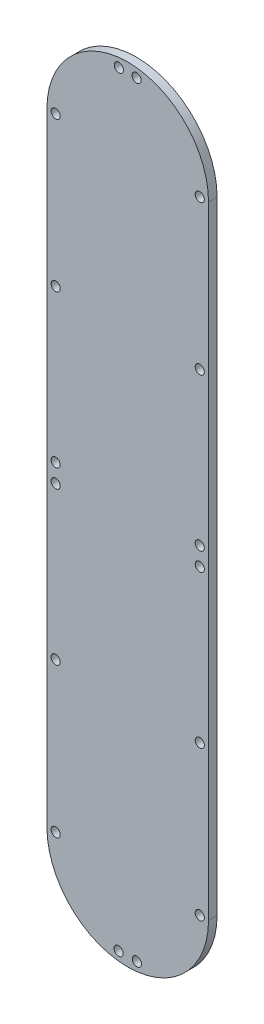
ISO-10303-21;
HEADER;
FILE_DESCRIPTION(('STEP AP214'),'2;1');
FILE_NAME('part.step','',(''),(''),'','','');
FILE_SCHEMA(('AUTOMOTIVE_DESIGN { 1 0 10303 214 1 1 1 1 }'));
ENDSEC;
DATA;
#1=APPLICATION_CONTEXT('core data for automotive mechanical design processes');
#2=APPLICATION_PROTOCOL_DEFINITION('international standard','automotive_design',2000,#1);
#3=PRODUCT_CONTEXT('',#1,'mechanical');
#4=PRODUCT('Part','Part','',(#3));
#5=PRODUCT_RELATED_PRODUCT_CATEGORY('part','',(#4));
#6=PRODUCT_DEFINITION_FORMATION('','',#4);
#7=PRODUCT_DEFINITION_CONTEXT('part definition',#1,'design');
#8=PRODUCT_DEFINITION('design','',#6,#7);
#9=PRODUCT_DEFINITION_SHAPE('','',#8);
#10=(LENGTH_UNIT() NAMED_UNIT(*) SI_UNIT(.MILLI.,.METRE.));
#11=(NAMED_UNIT(*) PLANE_ANGLE_UNIT() SI_UNIT($,.RADIAN.));
#12=(NAMED_UNIT(*) SI_UNIT($,.STERADIAN.) SOLID_ANGLE_UNIT());
#13=UNCERTAINTY_MEASURE_WITH_UNIT(LENGTH_MEASURE(1.E-05),#10,'distance_accuracy_value','');
#14=(GEOMETRIC_REPRESENTATION_CONTEXT(3) GLOBAL_UNCERTAINTY_ASSIGNED_CONTEXT((#13)) GLOBAL_UNIT_ASSIGNED_CONTEXT((#10,
#11,#12)) REPRESENTATION_CONTEXT('',''));
#15=CARTESIAN_POINT('',(0.,0.,0.));
#16=DIRECTION('',(0.,0.,1.));
#17=DIRECTION('',(1.,0.,0.));
#18=AXIS2_PLACEMENT_3D('',#15,#16,#17);
#19=CARTESIAN_POINT('',(24.5827179372451,-59.5829059297929,3.175));
#20=DIRECTION('',(0.,0.,-1.));
#21=DIRECTION('',(-1.,0.,0.));
#22=AXIS2_PLACEMENT_3D('',#19,#20,#21);
#23=CYLINDRICAL_SURFACE('',#22,30.);
#24=CARTESIAN_POINT('',(24.5827179372451,-59.5829059297929,0.));
#25=DIRECTION('',(0.,0.,-1.));
#26=DIRECTION('',(-1.,0.,0.));
#27=AXIS2_PLACEMENT_3D('',#24,#25,#26);
#28=CIRCLE('',#27,30.);
#29=CARTESIAN_POINT('',(54.5827179372451,-59.5829059297929,0.));
#30=VERTEX_POINT('',#29);
#31=CARTESIAN_POINT('',(-5.41728206275491,-59.5829059297929,0.));
#32=VERTEX_POINT('',#31);
#33=EDGE_CURVE('E98',#30,#32,#28,.T.);
#34=ORIENTED_EDGE('',*,*,#33,.F.);
#35=DIRECTION('',(0.,0.,-1.));
#36=VECTOR('',#35,1.);
#37=CARTESIAN_POINT('',(54.5827179372451,-59.5829059297929,3.175));
#38=LINE('',#37,#36);
#39=CARTESIAN_POINT('',(54.5827179372451,-59.5829059297929,3.175));
#40=VERTEX_POINT('',#39);
#41=EDGE_CURVE('E11',#40,#30,#38,.T.);
#42=ORIENTED_EDGE('',*,*,#41,.F.);
#43=CARTESIAN_POINT('',(24.5827179372451,-59.5829059297929,3.175));
#44=DIRECTION('',(0.,0.,-1.));
#45=DIRECTION('',(-1.,0.,0.));
#46=AXIS2_PLACEMENT_3D('',#43,#44,#45);
#47=CIRCLE('',#46,30.);
#48=CARTESIAN_POINT('',(-5.41728206275491,-59.5829059297929,3.175));
#49=VERTEX_POINT('',#48);
#50=EDGE_CURVE('E91',#40,#49,#47,.T.);
#51=ORIENTED_EDGE('',*,*,#50,.T.);
#52=DIRECTION('',(0.,0.,-1.));
#53=VECTOR('',#52,1.);
#54=CARTESIAN_POINT('',(-5.41728206275491,-59.5829059297929,3.175));
#55=LINE('',#54,#53);
#56=EDGE_CURVE('E36',#49,#32,#55,.T.);
#57=ORIENTED_EDGE('',*,*,#56,.T.);
#58=EDGE_LOOP('',(#34,#42,#51,#57));
#59=FACE_BOUND('',#58,.T.);
#60=ADVANCED_FACE('F33',(#59),#23,.T.);
#61=CARTESIAN_POINT('',(54.5827179372451,171.394622999198,3.175));
#62=DIRECTION('',(1.,0.,0.));
#63=DIRECTION('',(0.,1.,0.));
#64=AXIS2_PLACEMENT_3D('',#61,#62,#63);
#65=PLANE('',#64);
#66=DIRECTION('',(0.,-1.,0.));
#67=VECTOR('',#66,1.);
#68=CARTESIAN_POINT('',(54.5827179372451,171.394622999198,0.));
#69=LINE('',#68,#67);
#70=CARTESIAN_POINT('',(54.5827179372451,171.394622999198,0.));
#71=VERTEX_POINT('',#70);
#72=EDGE_CURVE('E93',#71,#30,#69,.T.);
#73=ORIENTED_EDGE('',*,*,#72,.F.);
#74=DIRECTION('',(0.,0.,-1.));
#75=VECTOR('',#74,1.);
#76=CARTESIAN_POINT('',(54.5827179372451,171.394622999198,3.175));
#77=LINE('',#76,#75);
#78=CARTESIAN_POINT('',(54.5827179372451,171.394622999198,3.175));
#79=VERTEX_POINT('',#78);
#80=EDGE_CURVE('E42',#79,#71,#77,.T.);
#81=ORIENTED_EDGE('',*,*,#80,.F.);
#82=DIRECTION('',(0.,-1.,0.));
#83=VECTOR('',#82,1.);
#84=CARTESIAN_POINT('',(54.5827179372451,171.394622999198,3.175));
#85=LINE('',#84,#83);
#86=EDGE_CURVE('E88',#79,#40,#85,.T.);
#87=ORIENTED_EDGE('',*,*,#86,.T.);
#88=ORIENTED_EDGE('',*,*,#41,.T.);
#89=EDGE_LOOP('',(#73,#81,#87,#88));
#90=FACE_BOUND('',#89,.T.);
#91=ADVANCED_FACE('F109',(#90),#65,.T.);
#92=CARTESIAN_POINT('',(24.5827179372451,171.394622999198,3.175));
#93=DIRECTION('',(0.,0.,-1.));
#94=DIRECTION('',(-1.,0.,0.));
#95=AXIS2_PLACEMENT_3D('',#92,#93,#94);
#96=CYLINDRICAL_SURFACE('',#95,30.);
#97=CARTESIAN_POINT('',(24.5827179372451,171.394622999198,0.));
#98=DIRECTION('',(0.,0.,-1.));
#99=DIRECTION('',(-1.,0.,0.));
#100=AXIS2_PLACEMENT_3D('',#97,#98,#99);
#101=CIRCLE('',#100,30.);
#102=CARTESIAN_POINT('',(-5.41728206275491,171.394622999198,0.));
#103=VERTEX_POINT('',#102);
#104=EDGE_CURVE('E83',#103,#71,#101,.T.);
#105=ORIENTED_EDGE('',*,*,#104,.F.);
#106=DIRECTION('',(0.,0.,-1.));
#107=VECTOR('',#106,1.);
#108=CARTESIAN_POINT('',(-5.41728206275491,171.394622999198,3.175));
#109=LINE('',#108,#107);
#110=CARTESIAN_POINT('',(-5.41728206275491,171.394622999198,3.175));
#111=VERTEX_POINT('',#110);
#112=EDGE_CURVE('E78',#111,#103,#109,.T.);
#113=ORIENTED_EDGE('',*,*,#112,.F.);
#114=CARTESIAN_POINT('',(24.5827179372451,171.394622999198,3.175));
#115=DIRECTION('',(0.,0.,-1.));
#116=DIRECTION('',(-1.,0.,0.));
#117=AXIS2_PLACEMENT_3D('',#114,#115,#116);
#118=CIRCLE('',#117,30.);
#119=EDGE_CURVE('E81',#111,#79,#118,.T.);
#120=ORIENTED_EDGE('',*,*,#119,.T.);
#121=ORIENTED_EDGE('',*,*,#80,.T.);
#122=EDGE_LOOP('',(#105,#113,#120,#121));
#123=FACE_BOUND('',#122,.T.);
#124=ADVANCED_FACE('F80',(#123),#96,.T.);
#125=CARTESIAN_POINT('',(-5.41728206275491,-59.5829059297929,3.175));
#126=DIRECTION('',(-1.,0.,0.));
#127=DIRECTION('',(0.,0.,1.));
#128=AXIS2_PLACEMENT_3D('',#125,#126,#127);
#129=PLANE('',#128);
#130=DIRECTION('',(0.,1.,0.));
#131=VECTOR('',#130,1.);
#132=CARTESIAN_POINT('',(-5.41728206275491,-59.5829059297929,0.));
#133=LINE('',#132,#131);
#134=EDGE_CURVE('E101',#32,#103,#133,.T.);
#135=ORIENTED_EDGE('',*,*,#134,.F.);
#136=ORIENTED_EDGE('',*,*,#56,.F.);
#137=DIRECTION('',(0.,1.,0.));
#138=VECTOR('',#137,1.);
#139=CARTESIAN_POINT('',(-5.41728206275491,-59.5829059297929,3.175));
#140=LINE('',#139,#138);
#141=EDGE_CURVE('E87',#49,#111,#140,.T.);
#142=ORIENTED_EDGE('',*,*,#141,.T.);
#143=ORIENTED_EDGE('',*,*,#112,.T.);
#144=EDGE_LOOP('',(#135,#136,#142,#143));
#145=FACE_BOUND('',#144,.T.);
#146=ADVANCED_FACE('F90',(#145),#129,.T.);
#147=CARTESIAN_POINT('',(24.5827179372451,-59.5829059297929,3.175));
#148=DIRECTION('',(0.,0.,-1.));
#149=DIRECTION('',(-1.,0.,0.));
#150=AXIS2_PLACEMENT_3D('',#147,#148,#149);
#151=PLANE('',#150);
#152=CARTESIAN_POINT('',(27.8827179372451,197.940291195723,3.175));
#153=DIRECTION('',(0.,0.,-1.));
#154=DIRECTION('',(1.,0.,0.));
#155=AXIS2_PLACEMENT_3D('',#152,#153,#154);
#156=CIRCLE('',#155,1.70000000000001);
#157=CARTESIAN_POINT('',(29.5827179372451,197.940291195723,3.175));
#158=VERTEX_POINT('',#157);
#159=EDGE_CURVE('E198',#158,#158,#156,.T.);
#160=ORIENTED_EDGE('',*,*,#159,.T.);
#161=EDGE_LOOP('',(#160));
#162=FACE_BOUND('',#161,.T.);
#163=CARTESIAN_POINT('',(-2.1672820627549,-59.5829059297927,3.175));
#164=DIRECTION('',(0.,0.,-1.));
#165=DIRECTION('',(1.,0.,0.));
#166=AXIS2_PLACEMENT_3D('',#163,#164,#165);
#167=CIRCLE('',#166,1.70000000000001);
#168=CARTESIAN_POINT('',(-0.467282062754892,-59.5829059297927,3.175));
#169=VERTEX_POINT('',#168);
#170=EDGE_CURVE('E206',#169,#169,#167,.T.);
#171=ORIENTED_EDGE('',*,*,#170,.T.);
#172=EDGE_LOOP('',(#171));
#173=FACE_BOUND('',#172,.T.);
#174=CARTESIAN_POINT('',(21.1827179372451,-86.1159513637418,3.175));
#175=DIRECTION('',(0.,0.,-1.));
#176=DIRECTION('',(1.,0.,0.));
#177=AXIS2_PLACEMENT_3D('',#174,#175,#176);
#178=CIRCLE('',#177,1.70000000000001);
#179=CARTESIAN_POINT('',(22.8827179372451,-86.1159513637418,3.175));
#180=VERTEX_POINT('',#179);
#181=EDGE_CURVE('E212',#180,#180,#178,.T.);
#182=ORIENTED_EDGE('',*,*,#181,.T.);
#183=EDGE_LOOP('',(#182));
#184=FACE_BOUND('',#183,.T.);
#185=CARTESIAN_POINT('',(51.3327179372474,171.3946229992,3.175));
#186=DIRECTION('',(0.,0.,-1.));
#187=DIRECTION('',(1.,0.,0.));
#188=AXIS2_PLACEMENT_3D('',#185,#186,#187);
#189=CIRCLE('',#188,1.70000000000001);
#190=CARTESIAN_POINT('',(53.0327179372474,171.3946229992,3.175));
#191=VERTEX_POINT('',#190);
#192=EDGE_CURVE('E218',#191,#191,#189,.T.);
#193=ORIENTED_EDGE('',*,*,#192,.T.);
#194=EDGE_LOOP('',(#193));
#195=FACE_BOUND('',#194,.T.);
#196=CARTESIAN_POINT('',(-2.1672820627549,59.3058585347025,3.175));
#197=DIRECTION('',(0.,0.,-1.));
#198=DIRECTION('',(1.,0.,0.));
#199=AXIS2_PLACEMENT_3D('',#196,#197,#198);
#200=CIRCLE('',#199,1.70000000000001);
#201=CARTESIAN_POINT('',(-0.46728206275489,59.3058585347025,3.175));
#202=VERTEX_POINT('',#201);
#203=EDGE_CURVE('E224',#202,#202,#200,.T.);
#204=ORIENTED_EDGE('',*,*,#203,.T.);
#205=EDGE_LOOP('',(#204));
#206=FACE_BOUND('',#205,.T.);
#207=CARTESIAN_POINT('',(27.9827179372451,-86.1159513637418,3.175));
#208=DIRECTION('',(0.,0.,-1.));
#209=DIRECTION('',(1.,0.,0.));
#210=AXIS2_PLACEMENT_3D('',#207,#208,#209);
#211=CIRCLE('',#210,1.70000000000001);
#212=CARTESIAN_POINT('',(29.6827179372451,-86.1159513637418,3.175));
#213=VERTEX_POINT('',#212);
#214=EDGE_CURVE('E230',#213,#213,#211,.T.);
#215=ORIENTED_EDGE('',*,*,#214,.T.);
#216=EDGE_LOOP('',(#215));
#217=FACE_BOUND('',#216,.T.);
#218=CARTESIAN_POINT('',(-2.16728206275266,171.394622999196,3.175));
#219=DIRECTION('',(0.,0.,-1.));
#220=DIRECTION('',(1.,0.,0.));
#221=AXIS2_PLACEMENT_3D('',#218,#219,#220);
#222=CIRCLE('',#221,1.70000000000001);
#223=CARTESIAN_POINT('',(-0.467282062752642,171.394622999196,3.175));
#224=VERTEX_POINT('',#223);
#225=EDGE_CURVE('E236',#224,#224,#222,.T.);
#226=ORIENTED_EDGE('',*,*,#225,.T.);
#227=EDGE_LOOP('',(#226));
#228=FACE_BOUND('',#227,.T.);
#229=CARTESIAN_POINT('',(51.3327179372449,115.905858534703,3.175));
#230=DIRECTION('',(0.,0.,-1.));
#231=DIRECTION('',(1.,0.,0.));
#232=AXIS2_PLACEMENT_3D('',#229,#230,#231);
#233=CIRCLE('',#232,1.70000000000001);
#234=CARTESIAN_POINT('',(53.0327179372449,115.905858534703,3.175));
#235=VERTEX_POINT('',#234);
#236=EDGE_CURVE('E242',#235,#235,#233,.T.);
#237=ORIENTED_EDGE('',*,*,#236,.T.);
#238=EDGE_LOOP('',(#237));
#239=FACE_BOUND('',#238,.T.);
#240=CARTESIAN_POINT('',(-2.16728206275513,115.905858534703,3.175));
#241=DIRECTION('',(0.,0.,-1.));
#242=DIRECTION('',(1.,0.,0.));
#243=AXIS2_PLACEMENT_3D('',#240,#241,#242);
#244=CIRCLE('',#243,1.70000000000001);
#245=CARTESIAN_POINT('',(-0.467282062755112,115.905858534703,3.175));
#246=VERTEX_POINT('',#245);
#247=EDGE_CURVE('E248',#246,#246,#244,.T.);
#248=ORIENTED_EDGE('',*,*,#247,.T.);
#249=EDGE_LOOP('',(#248));
#250=FACE_BOUND('',#249,.T.);
#251=CARTESIAN_POINT('',(51.3327179372451,-59.5829059297932,3.175));
#252=DIRECTION('',(0.,0.,-1.));
#253=DIRECTION('',(1.,0.,0.));
#254=AXIS2_PLACEMENT_3D('',#251,#252,#253);
#255=CIRCLE('',#254,1.7);
#256=CARTESIAN_POINT('',(53.0327179372451,-59.5829059297932,3.175));
#257=VERTEX_POINT('',#256);
#258=EDGE_CURVE('E254',#257,#257,#255,.T.);
#259=ORIENTED_EDGE('',*,*,#258,.T.);
#260=EDGE_LOOP('',(#259));
#261=FACE_BOUND('',#260,.T.);
#262=CARTESIAN_POINT('',(51.3327179372457,-4.09414146529746,3.175));
#263=DIRECTION('',(0.,0.,-1.));
#264=DIRECTION('',(1.,0.,0.));
#265=AXIS2_PLACEMENT_3D('',#262,#263,#264);
#266=CIRCLE('',#265,1.7);
#267=CARTESIAN_POINT('',(53.0327179372457,-4.09414146529746,3.175));
#268=VERTEX_POINT('',#267);
#269=EDGE_CURVE('E260',#268,#268,#266,.T.);
#270=ORIENTED_EDGE('',*,*,#269,.T.);
#271=EDGE_LOOP('',(#270));
#272=FACE_BOUND('',#271,.T.);
#273=CARTESIAN_POINT('',(-2.16728206275427,-4.09414146529746,3.175));
#274=DIRECTION('',(0.,0.,-1.));
#275=DIRECTION('',(1.,0.,0.));
#276=AXIS2_PLACEMENT_3D('',#273,#274,#275);
#277=CIRCLE('',#276,1.70000000000001);
#278=CARTESIAN_POINT('',(-0.467282062754254,-4.09414146529746,3.175));
#279=VERTEX_POINT('',#278);
#280=EDGE_CURVE('E266',#279,#279,#277,.T.);
#281=ORIENTED_EDGE('',*,*,#280,.T.);
#282=EDGE_LOOP('',(#281));
#283=FACE_BOUND('',#282,.T.);
#284=CARTESIAN_POINT('',(21.2827179372451,197.940291195723,3.175));
#285=DIRECTION('',(0.,0.,-1.));
#286=DIRECTION('',(1.,0.,0.));
#287=AXIS2_PLACEMENT_3D('',#284,#285,#286);
#288=CIRCLE('',#287,1.70000000000001);
#289=CARTESIAN_POINT('',(22.9827179372451,197.940291195723,3.175));
#290=VERTEX_POINT('',#289);
#291=EDGE_CURVE('E272',#290,#290,#288,.T.);
#292=ORIENTED_EDGE('',*,*,#291,.T.);
#293=EDGE_LOOP('',(#292));
#294=FACE_BOUND('',#293,.T.);
#295=CARTESIAN_POINT('',(51.3327179372451,52.5058585347025,3.175));
#296=DIRECTION('',(0.,0.,-1.));
#297=DIRECTION('',(1.,0.,0.));
#298=AXIS2_PLACEMENT_3D('',#295,#296,#297);
#299=CIRCLE('',#298,1.7);
#300=CARTESIAN_POINT('',(53.0327179372451,52.5058585347025,3.175));
#301=VERTEX_POINT('',#300);
#302=EDGE_CURVE('E278',#301,#301,#299,.T.);
#303=ORIENTED_EDGE('',*,*,#302,.T.);
#304=EDGE_LOOP('',(#303));
#305=FACE_BOUND('',#304,.T.);
#306=CARTESIAN_POINT('',(51.3327179372451,59.3058585347025,3.175));
#307=DIRECTION('',(0.,0.,-1.));
#308=DIRECTION('',(1.,0.,0.));
#309=AXIS2_PLACEMENT_3D('',#306,#307,#308);
#310=CIRCLE('',#309,1.7);
#311=CARTESIAN_POINT('',(53.0327179372451,59.3058585347025,3.175));
#312=VERTEX_POINT('',#311);
#313=EDGE_CURVE('E284',#312,#312,#310,.T.);
#314=ORIENTED_EDGE('',*,*,#313,.T.);
#315=EDGE_LOOP('',(#314));
#316=FACE_BOUND('',#315,.T.);
#317=CARTESIAN_POINT('',(-2.1672820627549,52.5058585347025,3.175));
#318=DIRECTION('',(0.,0.,-1.));
#319=DIRECTION('',(1.,0.,0.));
#320=AXIS2_PLACEMENT_3D('',#317,#318,#319);
#321=CIRCLE('',#320,1.70000000000001);
#322=CARTESIAN_POINT('',(-0.46728206275489,52.5058585347025,3.175));
#323=VERTEX_POINT('',#322);
#324=EDGE_CURVE('E102',#323,#323,#321,.T.);
#325=ORIENTED_EDGE('',*,*,#324,.T.);
#326=EDGE_LOOP('',(#325));
#327=FACE_BOUND('',#326,.T.);
#328=ORIENTED_EDGE('',*,*,#50,.F.);
#329=ORIENTED_EDGE('',*,*,#86,.F.);
#330=ORIENTED_EDGE('',*,*,#119,.F.);
#331=ORIENTED_EDGE('',*,*,#141,.F.);
#332=EDGE_LOOP('',(#328,#329,#330,#331));
#333=FACE_BOUND('',#332,.T.);
#334=ADVANCED_FACE('F86',(#162,#173,#184,#195,#206,#217,#228,#239,#250,#261,#272,#283,#294,#305,
#316,#327,#333),#151,.F.);
#335=CARTESIAN_POINT('',(24.5827179372451,-59.5829059297929,0.));
#336=DIRECTION('',(0.,0.,-1.));
#337=DIRECTION('',(-1.,0.,0.));
#338=AXIS2_PLACEMENT_3D('',#335,#336,#337);
#339=PLANE('',#338);
#340=CARTESIAN_POINT('',(27.8827179372451,197.940291195723,0.));
#341=DIRECTION('',(0.,0.,-1.));
#342=DIRECTION('',(1.,0.,0.));
#343=AXIS2_PLACEMENT_3D('',#340,#341,#342);
#344=CIRCLE('',#343,1.70000000000001);
#345=CARTESIAN_POINT('',(29.5827179372451,197.940291195723,0.));
#346=VERTEX_POINT('',#345);
#347=EDGE_CURVE('E201',#346,#346,#344,.T.);
#348=ORIENTED_EDGE('',*,*,#347,.F.);
#349=EDGE_LOOP('',(#348));
#350=FACE_BOUND('',#349,.T.);
#351=CARTESIAN_POINT('',(-2.1672820627549,-59.5829059297927,0.));
#352=DIRECTION('',(0.,0.,-1.));
#353=DIRECTION('',(1.,0.,0.));
#354=AXIS2_PLACEMENT_3D('',#351,#352,#353);
#355=CIRCLE('',#354,1.70000000000001);
#356=CARTESIAN_POINT('',(-0.467282062754892,-59.5829059297927,0.));
#357=VERTEX_POINT('',#356);
#358=EDGE_CURVE('E203',#357,#357,#355,.T.);
#359=ORIENTED_EDGE('',*,*,#358,.F.);
#360=EDGE_LOOP('',(#359));
#361=FACE_BOUND('',#360,.T.);
#362=CARTESIAN_POINT('',(21.1827179372451,-86.1159513637418,0.));
#363=DIRECTION('',(0.,0.,-1.));
#364=DIRECTION('',(1.,0.,0.));
#365=AXIS2_PLACEMENT_3D('',#362,#363,#364);
#366=CIRCLE('',#365,1.70000000000001);
#367=CARTESIAN_POINT('',(22.8827179372451,-86.1159513637418,0.));
#368=VERTEX_POINT('',#367);
#369=EDGE_CURVE('E209',#368,#368,#366,.T.);
#370=ORIENTED_EDGE('',*,*,#369,.F.);
#371=EDGE_LOOP('',(#370));
#372=FACE_BOUND('',#371,.T.);
#373=CARTESIAN_POINT('',(51.3327179372474,171.3946229992,0.));
#374=DIRECTION('',(0.,0.,-1.));
#375=DIRECTION('',(1.,0.,0.));
#376=AXIS2_PLACEMENT_3D('',#373,#374,#375);
#377=CIRCLE('',#376,1.70000000000001);
#378=CARTESIAN_POINT('',(53.0327179372474,171.3946229992,0.));
#379=VERTEX_POINT('',#378);
#380=EDGE_CURVE('E215',#379,#379,#377,.T.);
#381=ORIENTED_EDGE('',*,*,#380,.F.);
#382=EDGE_LOOP('',(#381));
#383=FACE_BOUND('',#382,.T.);
#384=CARTESIAN_POINT('',(-2.1672820627549,59.3058585347025,0.));
#385=DIRECTION('',(0.,0.,-1.));
#386=DIRECTION('',(1.,0.,0.));
#387=AXIS2_PLACEMENT_3D('',#384,#385,#386);
#388=CIRCLE('',#387,1.70000000000001);
#389=CARTESIAN_POINT('',(-0.46728206275489,59.3058585347025,0.));
#390=VERTEX_POINT('',#389);
#391=EDGE_CURVE('E221',#390,#390,#388,.T.);
#392=ORIENTED_EDGE('',*,*,#391,.F.);
#393=EDGE_LOOP('',(#392));
#394=FACE_BOUND('',#393,.T.);
#395=CARTESIAN_POINT('',(27.9827179372451,-86.1159513637418,0.));
#396=DIRECTION('',(0.,0.,-1.));
#397=DIRECTION('',(1.,0.,0.));
#398=AXIS2_PLACEMENT_3D('',#395,#396,#397);
#399=CIRCLE('',#398,1.70000000000001);
#400=CARTESIAN_POINT('',(29.6827179372451,-86.1159513637418,0.));
#401=VERTEX_POINT('',#400);
#402=EDGE_CURVE('E227',#401,#401,#399,.T.);
#403=ORIENTED_EDGE('',*,*,#402,.F.);
#404=EDGE_LOOP('',(#403));
#405=FACE_BOUND('',#404,.T.);
#406=CARTESIAN_POINT('',(-2.16728206275266,171.394622999196,0.));
#407=DIRECTION('',(0.,0.,-1.));
#408=DIRECTION('',(1.,0.,0.));
#409=AXIS2_PLACEMENT_3D('',#406,#407,#408);
#410=CIRCLE('',#409,1.70000000000001);
#411=CARTESIAN_POINT('',(-0.467282062752642,171.394622999196,0.));
#412=VERTEX_POINT('',#411);
#413=EDGE_CURVE('E233',#412,#412,#410,.T.);
#414=ORIENTED_EDGE('',*,*,#413,.F.);
#415=EDGE_LOOP('',(#414));
#416=FACE_BOUND('',#415,.T.);
#417=CARTESIAN_POINT('',(51.3327179372449,115.905858534703,0.));
#418=DIRECTION('',(0.,0.,-1.));
#419=DIRECTION('',(1.,0.,0.));
#420=AXIS2_PLACEMENT_3D('',#417,#418,#419);
#421=CIRCLE('',#420,1.70000000000001);
#422=CARTESIAN_POINT('',(53.0327179372449,115.905858534703,0.));
#423=VERTEX_POINT('',#422);
#424=EDGE_CURVE('E239',#423,#423,#421,.T.);
#425=ORIENTED_EDGE('',*,*,#424,.F.);
#426=EDGE_LOOP('',(#425));
#427=FACE_BOUND('',#426,.T.);
#428=CARTESIAN_POINT('',(-2.16728206275513,115.905858534703,0.));
#429=DIRECTION('',(0.,0.,-1.));
#430=DIRECTION('',(1.,0.,0.));
#431=AXIS2_PLACEMENT_3D('',#428,#429,#430);
#432=CIRCLE('',#431,1.70000000000001);
#433=CARTESIAN_POINT('',(-0.467282062755112,115.905858534703,0.));
#434=VERTEX_POINT('',#433);
#435=EDGE_CURVE('E245',#434,#434,#432,.T.);
#436=ORIENTED_EDGE('',*,*,#435,.F.);
#437=EDGE_LOOP('',(#436));
#438=FACE_BOUND('',#437,.T.);
#439=CARTESIAN_POINT('',(51.3327179372451,-59.5829059297932,0.));
#440=DIRECTION('',(0.,0.,-1.));
#441=DIRECTION('',(1.,0.,0.));
#442=AXIS2_PLACEMENT_3D('',#439,#440,#441);
#443=CIRCLE('',#442,1.7);
#444=CARTESIAN_POINT('',(53.0327179372451,-59.5829059297932,0.));
#445=VERTEX_POINT('',#444);
#446=EDGE_CURVE('E251',#445,#445,#443,.T.);
#447=ORIENTED_EDGE('',*,*,#446,.F.);
#448=EDGE_LOOP('',(#447));
#449=FACE_BOUND('',#448,.T.);
#450=CARTESIAN_POINT('',(51.3327179372457,-4.09414146529746,0.));
#451=DIRECTION('',(0.,0.,-1.));
#452=DIRECTION('',(1.,0.,0.));
#453=AXIS2_PLACEMENT_3D('',#450,#451,#452);
#454=CIRCLE('',#453,1.7);
#455=CARTESIAN_POINT('',(53.0327179372457,-4.09414146529746,0.));
#456=VERTEX_POINT('',#455);
#457=EDGE_CURVE('E257',#456,#456,#454,.T.);
#458=ORIENTED_EDGE('',*,*,#457,.F.);
#459=EDGE_LOOP('',(#458));
#460=FACE_BOUND('',#459,.T.);
#461=CARTESIAN_POINT('',(-2.16728206275427,-4.09414146529746,0.));
#462=DIRECTION('',(0.,0.,-1.));
#463=DIRECTION('',(1.,0.,0.));
#464=AXIS2_PLACEMENT_3D('',#461,#462,#463);
#465=CIRCLE('',#464,1.70000000000001);
#466=CARTESIAN_POINT('',(-0.467282062754254,-4.09414146529746,0.));
#467=VERTEX_POINT('',#466);
#468=EDGE_CURVE('E263',#467,#467,#465,.T.);
#469=ORIENTED_EDGE('',*,*,#468,.F.);
#470=EDGE_LOOP('',(#469));
#471=FACE_BOUND('',#470,.T.);
#472=CARTESIAN_POINT('',(21.2827179372451,197.940291195723,0.));
#473=DIRECTION('',(0.,0.,-1.));
#474=DIRECTION('',(1.,0.,0.));
#475=AXIS2_PLACEMENT_3D('',#472,#473,#474);
#476=CIRCLE('',#475,1.70000000000001);
#477=CARTESIAN_POINT('',(22.9827179372451,197.940291195723,0.));
#478=VERTEX_POINT('',#477);
#479=EDGE_CURVE('E269',#478,#478,#476,.T.);
#480=ORIENTED_EDGE('',*,*,#479,.F.);
#481=EDGE_LOOP('',(#480));
#482=FACE_BOUND('',#481,.T.);
#483=CARTESIAN_POINT('',(51.3327179372451,52.5058585347025,0.));
#484=DIRECTION('',(0.,0.,-1.));
#485=DIRECTION('',(1.,0.,0.));
#486=AXIS2_PLACEMENT_3D('',#483,#484,#485);
#487=CIRCLE('',#486,1.7);
#488=CARTESIAN_POINT('',(53.0327179372451,52.5058585347025,0.));
#489=VERTEX_POINT('',#488);
#490=EDGE_CURVE('E275',#489,#489,#487,.T.);
#491=ORIENTED_EDGE('',*,*,#490,.F.);
#492=EDGE_LOOP('',(#491));
#493=FACE_BOUND('',#492,.T.);
#494=CARTESIAN_POINT('',(51.3327179372451,59.3058585347025,0.));
#495=DIRECTION('',(0.,0.,-1.));
#496=DIRECTION('',(1.,0.,0.));
#497=AXIS2_PLACEMENT_3D('',#494,#495,#496);
#498=CIRCLE('',#497,1.7);
#499=CARTESIAN_POINT('',(53.0327179372451,59.3058585347025,0.));
#500=VERTEX_POINT('',#499);
#501=EDGE_CURVE('E281',#500,#500,#498,.T.);
#502=ORIENTED_EDGE('',*,*,#501,.F.);
#503=EDGE_LOOP('',(#502));
#504=FACE_BOUND('',#503,.T.);
#505=CARTESIAN_POINT('',(-2.1672820627549,52.5058585347025,0.));
#506=DIRECTION('',(0.,0.,-1.));
#507=DIRECTION('',(1.,0.,0.));
#508=AXIS2_PLACEMENT_3D('',#505,#506,#507);
#509=CIRCLE('',#508,1.70000000000001);
#510=CARTESIAN_POINT('',(-0.46728206275489,52.5058585347025,0.));
#511=VERTEX_POINT('',#510);
#512=EDGE_CURVE('E287',#511,#511,#509,.T.);
#513=ORIENTED_EDGE('',*,*,#512,.F.);
#514=EDGE_LOOP('',(#513));
#515=FACE_BOUND('',#514,.T.);
#516=ORIENTED_EDGE('',*,*,#33,.T.);
#517=ORIENTED_EDGE('',*,*,#134,.T.);
#518=ORIENTED_EDGE('',*,*,#104,.T.);
#519=ORIENTED_EDGE('',*,*,#72,.T.);
#520=EDGE_LOOP('',(#516,#517,#518,#519));
#521=FACE_BOUND('',#520,.T.);
#522=ADVANCED_FACE('F108',(#350,#361,#372,#383,#394,#405,#416,#427,#438,#449,#460,#471,#482,
#493,#504,#515,#521),#339,.T.);
#523=CARTESIAN_POINT('',(-2.1672820627549,52.5058585347025,3.175));
#524=DIRECTION('',(0.,0.,-1.));
#525=DIRECTION('',(-1.,0.,0.));
#526=AXIS2_PLACEMENT_3D('',#523,#524,#525);
#527=CYLINDRICAL_SURFACE('',#526,1.70000000000001);
#528=ORIENTED_EDGE('',*,*,#324,.F.);
#529=EDGE_LOOP('',(#528));
#530=FACE_BOUND('',#529,.T.);
#531=ORIENTED_EDGE('',*,*,#512,.T.);
#532=EDGE_LOOP('',(#531));
#533=FACE_BOUND('',#532,.T.);
#534=ADVANCED_FACE('F127',(#530,#533),#527,.F.);
#535=CARTESIAN_POINT('',(51.3327179372451,59.3058585347025,3.175));
#536=DIRECTION('',(0.,0.,-1.));
#537=DIRECTION('',(-1.,0.,0.));
#538=AXIS2_PLACEMENT_3D('',#535,#536,#537);
#539=CYLINDRICAL_SURFACE('',#538,1.7);
#540=ORIENTED_EDGE('',*,*,#313,.F.);
#541=EDGE_LOOP('',(#540));
#542=FACE_BOUND('',#541,.T.);
#543=ORIENTED_EDGE('',*,*,#501,.T.);
#544=EDGE_LOOP('',(#543));
#545=FACE_BOUND('',#544,.T.);
#546=ADVANCED_FACE('F134',(#542,#545),#539,.F.);
#547=CARTESIAN_POINT('',(51.3327179372451,52.5058585347025,3.175));
#548=DIRECTION('',(0.,0.,-1.));
#549=DIRECTION('',(-1.,0.,0.));
#550=AXIS2_PLACEMENT_3D('',#547,#548,#549);
#551=CYLINDRICAL_SURFACE('',#550,1.7);
#552=ORIENTED_EDGE('',*,*,#302,.F.);
#553=EDGE_LOOP('',(#552));
#554=FACE_BOUND('',#553,.T.);
#555=ORIENTED_EDGE('',*,*,#490,.T.);
#556=EDGE_LOOP('',(#555));
#557=FACE_BOUND('',#556,.T.);
#558=ADVANCED_FACE('F138',(#554,#557),#551,.F.);
#559=CARTESIAN_POINT('',(21.2827179372451,197.940291195723,3.175));
#560=DIRECTION('',(0.,0.,-1.));
#561=DIRECTION('',(-1.,0.,0.));
#562=AXIS2_PLACEMENT_3D('',#559,#560,#561);
#563=CYLINDRICAL_SURFACE('',#562,1.70000000000001);
#564=ORIENTED_EDGE('',*,*,#291,.F.);
#565=EDGE_LOOP('',(#564));
#566=FACE_BOUND('',#565,.T.);
#567=ORIENTED_EDGE('',*,*,#479,.T.);
#568=EDGE_LOOP('',(#567));
#569=FACE_BOUND('',#568,.T.);
#570=ADVANCED_FACE('F142',(#566,#569),#563,.F.);
#571=CARTESIAN_POINT('',(-2.16728206275427,-4.09414146529746,3.175));
#572=DIRECTION('',(0.,0.,-1.));
#573=DIRECTION('',(-1.,0.,0.));
#574=AXIS2_PLACEMENT_3D('',#571,#572,#573);
#575=CYLINDRICAL_SURFACE('',#574,1.70000000000001);
#576=ORIENTED_EDGE('',*,*,#280,.F.);
#577=EDGE_LOOP('',(#576));
#578=FACE_BOUND('',#577,.T.);
#579=ORIENTED_EDGE('',*,*,#468,.T.);
#580=EDGE_LOOP('',(#579));
#581=FACE_BOUND('',#580,.T.);
#582=ADVANCED_FACE('F146',(#578,#581),#575,.F.);
#583=CARTESIAN_POINT('',(51.3327179372457,-4.09414146529746,3.175));
#584=DIRECTION('',(0.,0.,-1.));
#585=DIRECTION('',(-1.,0.,0.));
#586=AXIS2_PLACEMENT_3D('',#583,#584,#585);
#587=CYLINDRICAL_SURFACE('',#586,1.7);
#588=ORIENTED_EDGE('',*,*,#269,.F.);
#589=EDGE_LOOP('',(#588));
#590=FACE_BOUND('',#589,.T.);
#591=ORIENTED_EDGE('',*,*,#457,.T.);
#592=EDGE_LOOP('',(#591));
#593=FACE_BOUND('',#592,.T.);
#594=ADVANCED_FACE('F150',(#590,#593),#587,.F.);
#595=CARTESIAN_POINT('',(51.3327179372451,-59.5829059297932,3.175));
#596=DIRECTION('',(0.,0.,-1.));
#597=DIRECTION('',(-1.,0.,0.));
#598=AXIS2_PLACEMENT_3D('',#595,#596,#597);
#599=CYLINDRICAL_SURFACE('',#598,1.7);
#600=ORIENTED_EDGE('',*,*,#258,.F.);
#601=EDGE_LOOP('',(#600));
#602=FACE_BOUND('',#601,.T.);
#603=ORIENTED_EDGE('',*,*,#446,.T.);
#604=EDGE_LOOP('',(#603));
#605=FACE_BOUND('',#604,.T.);
#606=ADVANCED_FACE('F154',(#602,#605),#599,.F.);
#607=CARTESIAN_POINT('',(-2.16728206275513,115.905858534703,3.175));
#608=DIRECTION('',(0.,0.,-1.));
#609=DIRECTION('',(-1.,0.,0.));
#610=AXIS2_PLACEMENT_3D('',#607,#608,#609);
#611=CYLINDRICAL_SURFACE('',#610,1.70000000000001);
#612=ORIENTED_EDGE('',*,*,#247,.F.);
#613=EDGE_LOOP('',(#612));
#614=FACE_BOUND('',#613,.T.);
#615=ORIENTED_EDGE('',*,*,#435,.T.);
#616=EDGE_LOOP('',(#615));
#617=FACE_BOUND('',#616,.T.);
#618=ADVANCED_FACE('F158',(#614,#617),#611,.F.);
#619=CARTESIAN_POINT('',(51.3327179372449,115.905858534703,3.175));
#620=DIRECTION('',(0.,0.,-1.));
#621=DIRECTION('',(-1.,0.,0.));
#622=AXIS2_PLACEMENT_3D('',#619,#620,#621);
#623=CYLINDRICAL_SURFACE('',#622,1.70000000000001);
#624=ORIENTED_EDGE('',*,*,#236,.F.);
#625=EDGE_LOOP('',(#624));
#626=FACE_BOUND('',#625,.T.);
#627=ORIENTED_EDGE('',*,*,#424,.T.);
#628=EDGE_LOOP('',(#627));
#629=FACE_BOUND('',#628,.T.);
#630=ADVANCED_FACE('F162',(#626,#629),#623,.F.);
#631=CARTESIAN_POINT('',(-2.16728206275266,171.394622999196,3.175));
#632=DIRECTION('',(0.,0.,-1.));
#633=DIRECTION('',(-1.,0.,0.));
#634=AXIS2_PLACEMENT_3D('',#631,#632,#633);
#635=CYLINDRICAL_SURFACE('',#634,1.70000000000001);
#636=ORIENTED_EDGE('',*,*,#225,.F.);
#637=EDGE_LOOP('',(#636));
#638=FACE_BOUND('',#637,.T.);
#639=ORIENTED_EDGE('',*,*,#413,.T.);
#640=EDGE_LOOP('',(#639));
#641=FACE_BOUND('',#640,.T.);
#642=ADVANCED_FACE('F166',(#638,#641),#635,.F.);
#643=CARTESIAN_POINT('',(27.9827179372451,-86.1159513637418,3.175));
#644=DIRECTION('',(0.,0.,-1.));
#645=DIRECTION('',(-1.,0.,0.));
#646=AXIS2_PLACEMENT_3D('',#643,#644,#645);
#647=CYLINDRICAL_SURFACE('',#646,1.70000000000001);
#648=ORIENTED_EDGE('',*,*,#214,.F.);
#649=EDGE_LOOP('',(#648));
#650=FACE_BOUND('',#649,.T.);
#651=ORIENTED_EDGE('',*,*,#402,.T.);
#652=EDGE_LOOP('',(#651));
#653=FACE_BOUND('',#652,.T.);
#654=ADVANCED_FACE('F170',(#650,#653),#647,.F.);
#655=CARTESIAN_POINT('',(-2.1672820627549,59.3058585347025,3.175));
#656=DIRECTION('',(0.,0.,-1.));
#657=DIRECTION('',(-1.,0.,0.));
#658=AXIS2_PLACEMENT_3D('',#655,#656,#657);
#659=CYLINDRICAL_SURFACE('',#658,1.70000000000001);
#660=ORIENTED_EDGE('',*,*,#203,.F.);
#661=EDGE_LOOP('',(#660));
#662=FACE_BOUND('',#661,.T.);
#663=ORIENTED_EDGE('',*,*,#391,.T.);
#664=EDGE_LOOP('',(#663));
#665=FACE_BOUND('',#664,.T.);
#666=ADVANCED_FACE('F174',(#662,#665),#659,.F.);
#667=CARTESIAN_POINT('',(51.3327179372474,171.3946229992,3.175));
#668=DIRECTION('',(0.,0.,-1.));
#669=DIRECTION('',(-1.,0.,0.));
#670=AXIS2_PLACEMENT_3D('',#667,#668,#669);
#671=CYLINDRICAL_SURFACE('',#670,1.70000000000001);
#672=ORIENTED_EDGE('',*,*,#192,.F.);
#673=EDGE_LOOP('',(#672));
#674=FACE_BOUND('',#673,.T.);
#675=ORIENTED_EDGE('',*,*,#380,.T.);
#676=EDGE_LOOP('',(#675));
#677=FACE_BOUND('',#676,.T.);
#678=ADVANCED_FACE('F178',(#674,#677),#671,.F.);
#679=CARTESIAN_POINT('',(21.1827179372451,-86.1159513637418,3.175));
#680=DIRECTION('',(0.,0.,-1.));
#681=DIRECTION('',(-1.,0.,0.));
#682=AXIS2_PLACEMENT_3D('',#679,#680,#681);
#683=CYLINDRICAL_SURFACE('',#682,1.70000000000001);
#684=ORIENTED_EDGE('',*,*,#181,.F.);
#685=EDGE_LOOP('',(#684));
#686=FACE_BOUND('',#685,.T.);
#687=ORIENTED_EDGE('',*,*,#369,.T.);
#688=EDGE_LOOP('',(#687));
#689=FACE_BOUND('',#688,.T.);
#690=ADVANCED_FACE('F182',(#686,#689),#683,.F.);
#691=CARTESIAN_POINT('',(-2.1672820627549,-59.5829059297927,3.175));
#692=DIRECTION('',(0.,0.,-1.));
#693=DIRECTION('',(-1.,0.,0.));
#694=AXIS2_PLACEMENT_3D('',#691,#692,#693);
#695=CYLINDRICAL_SURFACE('',#694,1.70000000000001);
#696=ORIENTED_EDGE('',*,*,#170,.F.);
#697=EDGE_LOOP('',(#696));
#698=FACE_BOUND('',#697,.T.);
#699=ORIENTED_EDGE('',*,*,#358,.T.);
#700=EDGE_LOOP('',(#699));
#701=FACE_BOUND('',#700,.T.);
#702=ADVANCED_FACE('F186',(#698,#701),#695,.F.);
#703=CARTESIAN_POINT('',(27.8827179372451,197.940291195723,3.175));
#704=DIRECTION('',(0.,0.,-1.));
#705=DIRECTION('',(-1.,0.,0.));
#706=AXIS2_PLACEMENT_3D('',#703,#704,#705);
#707=CYLINDRICAL_SURFACE('',#706,1.70000000000001);
#708=ORIENTED_EDGE('',*,*,#159,.F.);
#709=EDGE_LOOP('',(#708));
#710=FACE_BOUND('',#709,.T.);
#711=ORIENTED_EDGE('',*,*,#347,.T.);
#712=EDGE_LOOP('',(#711));
#713=FACE_BOUND('',#712,.T.);
#714=ADVANCED_FACE('F190',(#710,#713),#707,.F.);
#715=CLOSED_SHELL('',(#60,#91,#124,#146,#334,#522,#534,#546,#558,#570,#582,#594,#606,#618,#630,
#642,#654,#666,#678,#690,#702,#714));
#716=MANIFOLD_SOLID_BREP('B2',#715);
#717=ADVANCED_BREP_SHAPE_REPRESENTATION('',(#18,#716),#14);
#718=SHAPE_DEFINITION_REPRESENTATION(#9,#717);
ENDSEC;
END-ISO-10303-21;
